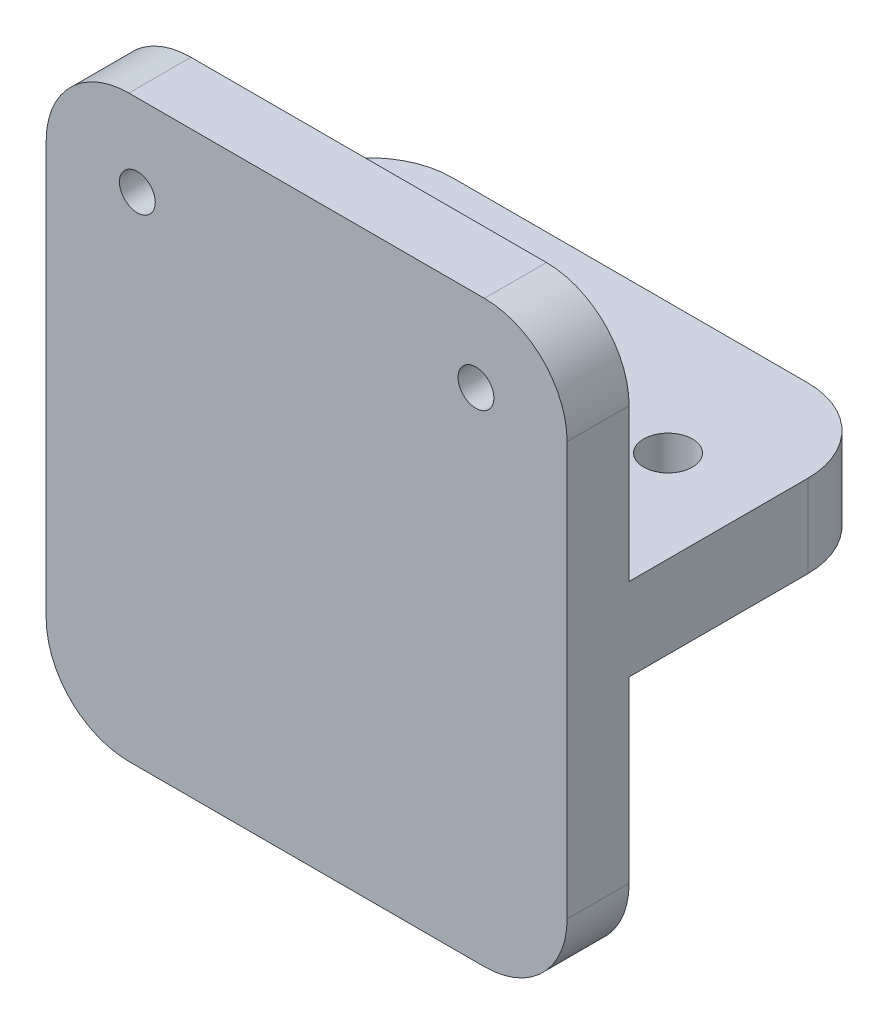
ISO-10303-21;
HEADER;
FILE_DESCRIPTION(('STEP AP214'),'2;1');
FILE_NAME('part.step','',(''),(''),'','','');
FILE_SCHEMA(('AUTOMOTIVE_DESIGN { 1 0 10303 214 1 1 1 1 }'));
ENDSEC;
DATA;
#1=APPLICATION_CONTEXT('core data for automotive mechanical design processes');
#2=APPLICATION_PROTOCOL_DEFINITION('international standard','automotive_design',2000,#1);
#3=PRODUCT_CONTEXT('',#1,'mechanical');
#4=PRODUCT('Part','Part','',(#3));
#5=PRODUCT_RELATED_PRODUCT_CATEGORY('part','',(#4));
#6=PRODUCT_DEFINITION_FORMATION('','',#4);
#7=PRODUCT_DEFINITION_CONTEXT('part definition',#1,'design');
#8=PRODUCT_DEFINITION('design','',#6,#7);
#9=PRODUCT_DEFINITION_SHAPE('','',#8);
#10=(LENGTH_UNIT() NAMED_UNIT(*) SI_UNIT(.MILLI.,.METRE.));
#11=(NAMED_UNIT(*) PLANE_ANGLE_UNIT() SI_UNIT($,.RADIAN.));
#12=(NAMED_UNIT(*) SI_UNIT($,.STERADIAN.) SOLID_ANGLE_UNIT());
#13=UNCERTAINTY_MEASURE_WITH_UNIT(LENGTH_MEASURE(1.E-05),#10,'distance_accuracy_value','');
#14=(GEOMETRIC_REPRESENTATION_CONTEXT(3) GLOBAL_UNCERTAINTY_ASSIGNED_CONTEXT((#13)) GLOBAL_UNIT_ASSIGNED_CONTEXT((#10,
#11,#12)) REPRESENTATION_CONTEXT('',''));
#15=CARTESIAN_POINT('',(0.,0.,0.));
#16=DIRECTION('',(0.,0.,1.));
#17=DIRECTION('',(1.,0.,0.));
#18=AXIS2_PLACEMENT_3D('',#15,#16,#17);
#19=CARTESIAN_POINT('',(0.,0.,0.));
#20=DIRECTION('',(0.,0.,-1.));
#21=DIRECTION('',(-1.,0.,0.));
#22=AXIS2_PLACEMENT_3D('',#19,#20,#21);
#23=PLANE('',#22);
#24=DIRECTION('',(-1.,0.,0.));
#25=VECTOR('',#24,1.);
#26=CARTESIAN_POINT('',(-20.,22.225,0.));
#27=LINE('',#26,#25);
#28=CARTESIAN_POINT('',(13.65,22.225,0.));
#29=VERTEX_POINT('',#28);
#30=CARTESIAN_POINT('',(-13.65,22.225,0.));
#31=VERTEX_POINT('',#30);
#32=EDGE_CURVE('E154',#29,#31,#27,.T.);
#33=ORIENTED_EDGE('',*,*,#32,.F.);
#34=CARTESIAN_POINT('',(13.65,15.875,0.));
#35=DIRECTION('',(0.,0.,-1.));
#36=DIRECTION('',(-1.,0.,0.));
#37=AXIS2_PLACEMENT_3D('',#34,#35,#36);
#38=CIRCLE('',#37,6.35);
#39=CARTESIAN_POINT('',(20.,15.875,0.));
#40=VERTEX_POINT('',#39);
#41=EDGE_CURVE('E11',#29,#40,#38,.T.);
#42=ORIENTED_EDGE('',*,*,#41,.T.);
#43=DIRECTION('',(0.,1.,0.));
#44=VECTOR('',#43,1.);
#45=CARTESIAN_POINT('',(20.,-22.225,0.));
#46=LINE('',#45,#44);
#47=CARTESIAN_POINT('',(20.,4.19099999999999,0.));
#48=VERTEX_POINT('',#47);
#49=EDGE_CURVE('E186',#48,#40,#46,.T.);
#50=ORIENTED_EDGE('',*,*,#49,.F.);
#51=DIRECTION('',(1.,0.,0.));
#52=VECTOR('',#51,1.);
#53=CARTESIAN_POINT('',(20.,4.19099999999999,0.));
#54=LINE('',#53,#52);
#55=CARTESIAN_POINT('',(-20.,4.19099999999999,0.));
#56=VERTEX_POINT('',#55);
#57=EDGE_CURVE('E159',#56,#48,#54,.T.);
#58=ORIENTED_EDGE('',*,*,#57,.F.);
#59=DIRECTION('',(0.,-1.,0.));
#60=VECTOR('',#59,1.);
#61=CARTESIAN_POINT('',(-20.,-22.225,0.));
#62=LINE('',#61,#60);
#63=CARTESIAN_POINT('',(-20.,15.875,0.));
#64=VERTEX_POINT('',#63);
#65=EDGE_CURVE('E153',#64,#56,#62,.T.);
#66=ORIENTED_EDGE('',*,*,#65,.F.);
#67=CARTESIAN_POINT('',(-13.65,15.875,0.));
#68=DIRECTION('',(0.,0.,-1.));
#69=DIRECTION('',(-1.,0.,0.));
#70=AXIS2_PLACEMENT_3D('',#67,#68,#69);
#71=CIRCLE('',#70,6.35);
#72=EDGE_CURVE('E40',#64,#31,#71,.T.);
#73=ORIENTED_EDGE('',*,*,#72,.T.);
#74=EDGE_LOOP('',(#33,#42,#50,#58,#66,#73));
#75=FACE_BOUND('',#74,.T.);
#76=CARTESIAN_POINT('',(-13.,15.9586820083682,0.));
#77=DIRECTION('',(0.,0.,1.));
#78=DIRECTION('',(1.,0.,0.));
#79=AXIS2_PLACEMENT_3D('',#76,#77,#78);
#80=CIRCLE('',#79,1.375);
#81=CARTESIAN_POINT('',(-11.625,15.9586820083682,0.));
#82=VERTEX_POINT('',#81);
#83=EDGE_CURVE('E180',#82,#82,#80,.T.);
#84=ORIENTED_EDGE('',*,*,#83,.T.);
#85=EDGE_LOOP('',(#84));
#86=FACE_BOUND('',#85,.T.);
#87=CARTESIAN_POINT('',(13.,15.9586820083682,0.));
#88=DIRECTION('',(0.,0.,1.));
#89=DIRECTION('',(1.,0.,0.));
#90=AXIS2_PLACEMENT_3D('',#87,#88,#89);
#91=CIRCLE('',#90,1.375);
#92=CARTESIAN_POINT('',(14.375,15.9586820083682,0.));
#93=VERTEX_POINT('',#92);
#94=EDGE_CURVE('E176',#93,#93,#91,.T.);
#95=ORIENTED_EDGE('',*,*,#94,.T.);
#96=EDGE_LOOP('',(#95));
#97=FACE_BOUND('',#96,.T.);
#98=ADVANCED_FACE('F32',(#75,#86,#97),#23,.T.);
#99=CARTESIAN_POINT('',(0.,0.,4.7625));
#100=DIRECTION('',(0.,0.,-1.));
#101=DIRECTION('',(-1.,0.,0.));
#102=AXIS2_PLACEMENT_3D('',#99,#100,#101);
#103=PLANE('',#102);
#104=DIRECTION('',(1.,0.,0.));
#105=VECTOR('',#104,1.);
#106=CARTESIAN_POINT('',(-20.,-22.225,4.7625));
#107=LINE('',#106,#105);
#108=CARTESIAN_POINT('',(-13.65,-22.225,4.7625));
#109=VERTEX_POINT('',#108);
#110=CARTESIAN_POINT('',(13.65,-22.225,4.7625));
#111=VERTEX_POINT('',#110);
#112=EDGE_CURVE('E199',#109,#111,#107,.T.);
#113=ORIENTED_EDGE('',*,*,#112,.T.);
#114=CARTESIAN_POINT('',(13.65,-15.875,4.7625));
#115=DIRECTION('',(0.,0.,-1.));
#116=DIRECTION('',(-1.,0.,0.));
#117=AXIS2_PLACEMENT_3D('',#114,#115,#116);
#118=CIRCLE('',#117,6.35);
#119=CARTESIAN_POINT('',(20.,-15.875,4.7625));
#120=VERTEX_POINT('',#119);
#121=EDGE_CURVE('E229',#111,#120,#118,.F.);
#122=ORIENTED_EDGE('',*,*,#121,.T.);
#123=DIRECTION('',(0.,1.,0.));
#124=VECTOR('',#123,1.);
#125=CARTESIAN_POINT('',(20.,-22.225,4.7625));
#126=LINE('',#125,#124);
#127=CARTESIAN_POINT('',(20.,15.875,4.7625));
#128=VERTEX_POINT('',#127);
#129=EDGE_CURVE('E189',#120,#128,#126,.T.);
#130=ORIENTED_EDGE('',*,*,#129,.T.);
#131=CARTESIAN_POINT('',(13.65,15.875,4.7625));
#132=DIRECTION('',(0.,0.,-1.));
#133=DIRECTION('',(-1.,0.,0.));
#134=AXIS2_PLACEMENT_3D('',#131,#132,#133);
#135=CIRCLE('',#134,6.35);
#136=CARTESIAN_POINT('',(13.65,22.225,4.7625));
#137=VERTEX_POINT('',#136);
#138=EDGE_CURVE('E225',#128,#137,#135,.F.);
#139=ORIENTED_EDGE('',*,*,#138,.T.);
#140=DIRECTION('',(-1.,0.,0.));
#141=VECTOR('',#140,1.);
#142=CARTESIAN_POINT('',(-20.,22.225,4.7625));
#143=LINE('',#142,#141);
#144=CARTESIAN_POINT('',(-13.65,22.225,4.7625));
#145=VERTEX_POINT('',#144);
#146=EDGE_CURVE('E192',#137,#145,#143,.T.);
#147=ORIENTED_EDGE('',*,*,#146,.T.);
#148=CARTESIAN_POINT('',(-13.65,15.875,4.7625));
#149=DIRECTION('',(0.,0.,-1.));
#150=DIRECTION('',(-1.,0.,0.));
#151=AXIS2_PLACEMENT_3D('',#148,#149,#150);
#152=CIRCLE('',#151,6.35);
#153=CARTESIAN_POINT('',(-20.,15.875,4.7625));
#154=VERTEX_POINT('',#153);
#155=EDGE_CURVE('E223',#145,#154,#152,.F.);
#156=ORIENTED_EDGE('',*,*,#155,.T.);
#157=DIRECTION('',(0.,-1.,0.));
#158=VECTOR('',#157,1.);
#159=CARTESIAN_POINT('',(-20.,-22.225,4.7625));
#160=LINE('',#159,#158);
#161=CARTESIAN_POINT('',(-20.,-15.875,4.7625));
#162=VERTEX_POINT('',#161);
#163=EDGE_CURVE('E196',#154,#162,#160,.T.);
#164=ORIENTED_EDGE('',*,*,#163,.T.);
#165=CARTESIAN_POINT('',(-13.65,-15.875,4.7625));
#166=DIRECTION('',(0.,0.,-1.));
#167=DIRECTION('',(-1.,0.,0.));
#168=AXIS2_PLACEMENT_3D('',#165,#166,#167);
#169=CIRCLE('',#168,6.35);
#170=EDGE_CURVE('E227',#162,#109,#169,.F.);
#171=ORIENTED_EDGE('',*,*,#170,.T.);
#172=EDGE_LOOP('',(#113,#122,#130,#139,#147,#156,#164,#171));
#173=FACE_BOUND('',#172,.T.);
#174=CARTESIAN_POINT('',(-13.,15.9586820083682,4.7625));
#175=DIRECTION('',(0.,0.,1.));
#176=DIRECTION('',(1.,0.,0.));
#177=AXIS2_PLACEMENT_3D('',#174,#175,#176);
#178=CIRCLE('',#177,1.375);
#179=CARTESIAN_POINT('',(-11.625,15.9586820083682,4.7625));
#180=VERTEX_POINT('',#179);
#181=EDGE_CURVE('E183',#180,#180,#178,.T.);
#182=ORIENTED_EDGE('',*,*,#181,.F.);
#183=EDGE_LOOP('',(#182));
#184=FACE_BOUND('',#183,.T.);
#185=CARTESIAN_POINT('',(13.,15.9586820083682,4.7625));
#186=DIRECTION('',(0.,0.,1.));
#187=DIRECTION('',(1.,0.,0.));
#188=AXIS2_PLACEMENT_3D('',#185,#186,#187);
#189=CIRCLE('',#188,1.375);
#190=CARTESIAN_POINT('',(14.375,15.9586820083682,4.7625));
#191=VERTEX_POINT('',#190);
#192=EDGE_CURVE('E177',#191,#191,#189,.T.);
#193=ORIENTED_EDGE('',*,*,#192,.F.);
#194=EDGE_LOOP('',(#193));
#195=FACE_BOUND('',#194,.T.);
#196=ADVANCED_FACE('F269',(#173,#184,#195),#103,.F.);
#197=CARTESIAN_POINT('',(20.,-15.875,0.));
#198=VERTEX_POINT('',#197);
#199=CARTESIAN_POINT('',(20.,-2.15900000000001,0.));
#200=VERTEX_POINT('',#199);
#201=EDGE_CURVE('E203',#198,#200,#46,.T.);
#202=ORIENTED_EDGE('',*,*,#201,.F.);
#203=CARTESIAN_POINT('',(13.65,-15.875,0.));
#204=DIRECTION('',(0.,0.,-1.));
#205=DIRECTION('',(-1.,0.,0.));
#206=AXIS2_PLACEMENT_3D('',#203,#204,#205);
#207=CIRCLE('',#206,6.35);
#208=CARTESIAN_POINT('',(13.65,-22.225,0.));
#209=VERTEX_POINT('',#208);
#210=EDGE_CURVE('E216',#198,#209,#207,.T.);
#211=ORIENTED_EDGE('',*,*,#210,.T.);
#212=DIRECTION('',(1.,0.,0.));
#213=VECTOR('',#212,1.);
#214=CARTESIAN_POINT('',(-20.,-22.225,0.));
#215=LINE('',#214,#213);
#216=CARTESIAN_POINT('',(-13.65,-22.225,0.));
#217=VERTEX_POINT('',#216);
#218=EDGE_CURVE('E193',#217,#209,#215,.T.);
#219=ORIENTED_EDGE('',*,*,#218,.F.);
#220=CARTESIAN_POINT('',(-13.65,-15.875,0.));
#221=DIRECTION('',(0.,0.,-1.));
#222=DIRECTION('',(-1.,0.,0.));
#223=AXIS2_PLACEMENT_3D('',#220,#221,#222);
#224=CIRCLE('',#223,6.35);
#225=CARTESIAN_POINT('',(-20.,-15.875,0.));
#226=VERTEX_POINT('',#225);
#227=EDGE_CURVE('E152',#217,#226,#224,.T.);
#228=ORIENTED_EDGE('',*,*,#227,.T.);
#229=CARTESIAN_POINT('',(-20.,-2.15900000000001,0.));
#230=VERTEX_POINT('',#229);
#231=EDGE_CURVE('E135',#230,#226,#62,.T.);
#232=ORIENTED_EDGE('',*,*,#231,.F.);
#233=DIRECTION('',(-1.,0.,0.));
#234=VECTOR('',#233,1.);
#235=CARTESIAN_POINT('',(20.,-2.15900000000001,0.));
#236=LINE('',#235,#234);
#237=EDGE_CURVE('E150',#200,#230,#236,.T.);
#238=ORIENTED_EDGE('',*,*,#237,.F.);
#239=EDGE_LOOP('',(#202,#211,#219,#228,#232,#238));
#240=FACE_BOUND('',#239,.T.);
#241=ADVANCED_FACE('F149',(#240),#23,.T.);
#242=CARTESIAN_POINT('',(20.,-22.225,4.7625));
#243=DIRECTION('',(-1.,0.,0.));
#244=DIRECTION('',(0.,0.,1.));
#245=AXIS2_PLACEMENT_3D('',#242,#243,#244);
#246=PLANE('',#245);
#247=ORIENTED_EDGE('',*,*,#129,.F.);
#248=DIRECTION('',(0.,0.,-1.));
#249=VECTOR('',#248,1.);
#250=CARTESIAN_POINT('',(20.,-15.875,4.7625));
#251=LINE('',#250,#249);
#252=EDGE_CURVE('E212',#120,#198,#251,.T.);
#253=ORIENTED_EDGE('',*,*,#252,.T.);
#254=ORIENTED_EDGE('',*,*,#201,.T.);
#255=DIRECTION('',(0.,0.,1.));
#256=VECTOR('',#255,1.);
#257=CARTESIAN_POINT('',(20.,-2.15900000000001,-20.066));
#258=LINE('',#257,#256);
#259=CARTESIAN_POINT('',(20.,-2.15900000000001,-13.716));
#260=VERTEX_POINT('',#259);
#261=EDGE_CURVE('E143',#260,#200,#258,.T.);
#262=ORIENTED_EDGE('',*,*,#261,.F.);
#263=DIRECTION('',(0.,-1.,0.));
#264=VECTOR('',#263,1.);
#265=CARTESIAN_POINT('',(20.,4.19099999999999,-13.716));
#266=LINE('',#265,#264);
#267=CARTESIAN_POINT('',(20.,4.19099999999999,-13.716));
#268=VERTEX_POINT('',#267);
#269=EDGE_CURVE('E210',#260,#268,#266,.F.);
#270=ORIENTED_EDGE('',*,*,#269,.T.);
#271=DIRECTION('',(0.,0.,1.));
#272=VECTOR('',#271,1.);
#273=CARTESIAN_POINT('',(20.,4.19099999999999,-20.066));
#274=LINE('',#273,#272);
#275=EDGE_CURVE('E172',#268,#48,#274,.T.);
#276=ORIENTED_EDGE('',*,*,#275,.T.);
#277=ORIENTED_EDGE('',*,*,#49,.T.);
#278=DIRECTION('',(0.,0.,-1.));
#279=VECTOR('',#278,1.);
#280=CARTESIAN_POINT('',(20.,15.875,4.7625));
#281=LINE('',#280,#279);
#282=EDGE_CURVE('E202',#40,#128,#281,.F.);
#283=ORIENTED_EDGE('',*,*,#282,.T.);
#284=EDGE_LOOP('',(#247,#253,#254,#262,#270,#276,#277,#283));
#285=FACE_BOUND('',#284,.T.);
#286=ADVANCED_FACE('F265',(#285),#246,.F.);
#287=CARTESIAN_POINT('',(-20.,22.225,4.7625));
#288=DIRECTION('',(0.,-1.,0.));
#289=DIRECTION('',(1.,0.,0.));
#290=AXIS2_PLACEMENT_3D('',#287,#288,#289);
#291=PLANE('',#290);
#292=ORIENTED_EDGE('',*,*,#146,.F.);
#293=DIRECTION('',(0.,0.,-1.));
#294=VECTOR('',#293,1.);
#295=CARTESIAN_POINT('',(13.65,22.225,4.7625));
#296=LINE('',#295,#294);
#297=EDGE_CURVE('E253',#137,#29,#296,.T.);
#298=ORIENTED_EDGE('',*,*,#297,.T.);
#299=ORIENTED_EDGE('',*,*,#32,.T.);
#300=DIRECTION('',(0.,0.,-1.));
#301=VECTOR('',#300,1.);
#302=CARTESIAN_POINT('',(-13.65,22.225,4.7625));
#303=LINE('',#302,#301);
#304=EDGE_CURVE('E251',#31,#145,#303,.F.);
#305=ORIENTED_EDGE('',*,*,#304,.T.);
#306=EDGE_LOOP('',(#292,#298,#299,#305));
#307=FACE_BOUND('',#306,.T.);
#308=ADVANCED_FACE('F256',(#307),#291,.F.);
#309=CARTESIAN_POINT('',(-20.,-22.225,4.7625));
#310=DIRECTION('',(1.,0.,0.));
#311=DIRECTION('',(0.,1.,0.));
#312=AXIS2_PLACEMENT_3D('',#309,#310,#311);
#313=PLANE('',#312);
#314=ORIENTED_EDGE('',*,*,#231,.T.);
#315=DIRECTION('',(0.,0.,-1.));
#316=VECTOR('',#315,1.);
#317=CARTESIAN_POINT('',(-20.,-15.875,4.7625));
#318=LINE('',#317,#316);
#319=EDGE_CURVE('E235',#226,#162,#318,.F.);
#320=ORIENTED_EDGE('',*,*,#319,.T.);
#321=ORIENTED_EDGE('',*,*,#163,.F.);
#322=DIRECTION('',(0.,0.,-1.));
#323=VECTOR('',#322,1.);
#324=CARTESIAN_POINT('',(-20.,15.875,4.7625));
#325=LINE('',#324,#323);
#326=EDGE_CURVE('E231',#154,#64,#325,.T.);
#327=ORIENTED_EDGE('',*,*,#326,.T.);
#328=ORIENTED_EDGE('',*,*,#65,.T.);
#329=DIRECTION('',(0.,0.,1.));
#330=VECTOR('',#329,1.);
#331=CARTESIAN_POINT('',(-20.,4.19099999999999,-20.066));
#332=LINE('',#331,#330);
#333=CARTESIAN_POINT('',(-20.,4.19099999999999,-13.716));
#334=VERTEX_POINT('',#333);
#335=EDGE_CURVE('E144',#334,#56,#332,.T.);
#336=ORIENTED_EDGE('',*,*,#335,.F.);
#337=DIRECTION('',(0.,1.,0.));
#338=VECTOR('',#337,1.);
#339=CARTESIAN_POINT('',(-20.,-2.15900000000001,-13.716));
#340=LINE('',#339,#338);
#341=CARTESIAN_POINT('',(-20.,-2.15900000000001,-13.716));
#342=VERTEX_POINT('',#341);
#343=EDGE_CURVE('E139',#334,#342,#340,.F.);
#344=ORIENTED_EDGE('',*,*,#343,.T.);
#345=DIRECTION('',(0.,0.,1.));
#346=VECTOR('',#345,1.);
#347=CARTESIAN_POINT('',(-20.,-2.15900000000001,-20.066));
#348=LINE('',#347,#346);
#349=EDGE_CURVE('E132',#342,#230,#348,.T.);
#350=ORIENTED_EDGE('',*,*,#349,.T.);
#351=EDGE_LOOP('',(#314,#320,#321,#327,#328,#336,#344,#350));
#352=FACE_BOUND('',#351,.T.);
#353=ADVANCED_FACE('F134',(#352),#313,.F.);
#354=CARTESIAN_POINT('',(-20.,-22.225,4.7625));
#355=DIRECTION('',(0.,1.,0.));
#356=DIRECTION('',(0.,0.,1.));
#357=AXIS2_PLACEMENT_3D('',#354,#355,#356);
#358=PLANE('',#357);
#359=ORIENTED_EDGE('',*,*,#218,.T.);
#360=DIRECTION('',(0.,0.,-1.));
#361=VECTOR('',#360,1.);
#362=CARTESIAN_POINT('',(13.65,-22.225,4.7625));
#363=LINE('',#362,#361);
#364=EDGE_CURVE('E221',#209,#111,#363,.F.);
#365=ORIENTED_EDGE('',*,*,#364,.T.);
#366=ORIENTED_EDGE('',*,*,#112,.F.);
#367=DIRECTION('',(0.,0.,-1.));
#368=VECTOR('',#367,1.);
#369=CARTESIAN_POINT('',(-13.65,-22.225,4.7625));
#370=LINE('',#369,#368);
#371=EDGE_CURVE('E218',#109,#217,#370,.T.);
#372=ORIENTED_EDGE('',*,*,#371,.T.);
#373=EDGE_LOOP('',(#359,#365,#366,#372));
#374=FACE_BOUND('',#373,.T.);
#375=ADVANCED_FACE('F278',(#374),#358,.F.);
#376=CARTESIAN_POINT('',(-13.,15.9586820083682,4.7625));
#377=DIRECTION('',(0.,0.,-1.));
#378=DIRECTION('',(-1.,0.,0.));
#379=AXIS2_PLACEMENT_3D('',#376,#377,#378);
#380=CYLINDRICAL_SURFACE('',#379,1.375);
#381=ORIENTED_EDGE('',*,*,#181,.T.);
#382=EDGE_LOOP('',(#381));
#383=FACE_BOUND('',#382,.T.);
#384=ORIENTED_EDGE('',*,*,#83,.F.);
#385=EDGE_LOOP('',(#384));
#386=FACE_BOUND('',#385,.T.);
#387=ADVANCED_FACE('F331',(#383,#386),#380,.F.);
#388=CARTESIAN_POINT('',(13.,15.9586820083682,4.7625));
#389=DIRECTION('',(0.,0.,-1.));
#390=DIRECTION('',(-1.,0.,0.));
#391=AXIS2_PLACEMENT_3D('',#388,#389,#390);
#392=CYLINDRICAL_SURFACE('',#391,1.375);
#393=ORIENTED_EDGE('',*,*,#192,.T.);
#394=EDGE_LOOP('',(#393));
#395=FACE_BOUND('',#394,.T.);
#396=ORIENTED_EDGE('',*,*,#94,.F.);
#397=EDGE_LOOP('',(#396));
#398=FACE_BOUND('',#397,.T.);
#399=ADVANCED_FACE('F325',(#395,#398),#392,.F.);
#400=CARTESIAN_POINT('',(20.,-2.15900000000001,-20.066));
#401=DIRECTION('',(0.,1.,0.));
#402=DIRECTION('',(-1.,0.,0.));
#403=AXIS2_PLACEMENT_3D('',#400,#401,#402);
#404=PLANE('',#403);
#405=CARTESIAN_POINT('',(12.954,-2.15900000000001,-10.033));
#406=DIRECTION('',(0.,1.,0.));
#407=DIRECTION('',(-1.,0.,0.));
#408=AXIS2_PLACEMENT_3D('',#405,#406,#407);
#409=CIRCLE('',#408,1.875);
#410=CARTESIAN_POINT('',(11.079,-2.15900000000001,-10.033));
#411=VERTEX_POINT('',#410);
#412=EDGE_CURVE('E160',#411,#411,#409,.T.);
#413=ORIENTED_EDGE('',*,*,#412,.T.);
#414=EDGE_LOOP('',(#413));
#415=FACE_BOUND('',#414,.T.);
#416=CARTESIAN_POINT('',(-12.954,-2.15900000000001,-10.033));
#417=DIRECTION('',(0.,1.,0.));
#418=DIRECTION('',(-1.,0.,0.));
#419=AXIS2_PLACEMENT_3D('',#416,#417,#418);
#420=CIRCLE('',#419,1.875);
#421=CARTESIAN_POINT('',(-14.829,-2.15900000000001,-10.033));
#422=VERTEX_POINT('',#421);
#423=EDGE_CURVE('E166',#422,#422,#420,.T.);
#424=ORIENTED_EDGE('',*,*,#423,.T.);
#425=EDGE_LOOP('',(#424));
#426=FACE_BOUND('',#425,.T.);
#427=ORIENTED_EDGE('',*,*,#349,.F.);
#428=CARTESIAN_POINT('',(-13.65,-2.15900000000001,-13.716));
#429=DIRECTION('',(0.,1.,0.));
#430=DIRECTION('',(-1.,0.,0.));
#431=AXIS2_PLACEMENT_3D('',#428,#429,#430);
#432=CIRCLE('',#431,6.35);
#433=CARTESIAN_POINT('',(-13.65,-2.15900000000001,-20.066));
#434=VERTEX_POINT('',#433);
#435=EDGE_CURVE('E249',#342,#434,#432,.F.);
#436=ORIENTED_EDGE('',*,*,#435,.T.);
#437=DIRECTION('',(-1.,0.,0.));
#438=VECTOR('',#437,1.);
#439=CARTESIAN_POINT('',(20.,-2.15900000000001,-20.066));
#440=LINE('',#439,#438);
#441=CARTESIAN_POINT('',(13.65,-2.15900000000001,-20.066));
#442=VERTEX_POINT('',#441);
#443=EDGE_CURVE('E163',#442,#434,#440,.T.);
#444=ORIENTED_EDGE('',*,*,#443,.F.);
#445=CARTESIAN_POINT('',(13.65,-2.15900000000001,-13.716));
#446=DIRECTION('',(0.,1.,0.));
#447=DIRECTION('',(-1.,0.,0.));
#448=AXIS2_PLACEMENT_3D('',#445,#446,#447);
#449=CIRCLE('',#448,6.35);
#450=EDGE_CURVE('E247',#442,#260,#449,.F.);
#451=ORIENTED_EDGE('',*,*,#450,.T.);
#452=ORIENTED_EDGE('',*,*,#261,.T.);
#453=ORIENTED_EDGE('',*,*,#237,.T.);
#454=EDGE_LOOP('',(#427,#436,#444,#451,#452,#453));
#455=FACE_BOUND('',#454,.T.);
#456=ADVANCED_FACE('F156',(#415,#426,#455),#404,.F.);
#457=CARTESIAN_POINT('',(20.,4.19099999999999,-20.066));
#458=DIRECTION('',(0.,-1.,0.));
#459=DIRECTION('',(0.,0.,-1.));
#460=AXIS2_PLACEMENT_3D('',#457,#458,#459);
#461=PLANE('',#460);
#462=CARTESIAN_POINT('',(12.954,4.19099999999999,-10.033));
#463=DIRECTION('',(0.,1.,0.));
#464=DIRECTION('',(0.,0.,1.));
#465=AXIS2_PLACEMENT_3D('',#462,#463,#464);
#466=CIRCLE('',#465,1.875);
#467=CARTESIAN_POINT('',(12.954,4.19099999999999,-8.158));
#468=VERTEX_POINT('',#467);
#469=EDGE_CURVE('E303',#468,#468,#466,.T.);
#470=ORIENTED_EDGE('',*,*,#469,.F.);
#471=EDGE_LOOP('',(#470));
#472=FACE_BOUND('',#471,.T.);
#473=CARTESIAN_POINT('',(-12.954,4.19099999999999,-10.033));
#474=DIRECTION('',(0.,1.,0.));
#475=DIRECTION('',(0.,0.,1.));
#476=AXIS2_PLACEMENT_3D('',#473,#474,#475);
#477=CIRCLE('',#476,1.875);
#478=CARTESIAN_POINT('',(-12.954,4.19099999999999,-8.158));
#479=VERTEX_POINT('',#478);
#480=EDGE_CURVE('E304',#479,#479,#477,.T.);
#481=ORIENTED_EDGE('',*,*,#480,.F.);
#482=EDGE_LOOP('',(#481));
#483=FACE_BOUND('',#482,.T.);
#484=DIRECTION('',(1.,0.,0.));
#485=VECTOR('',#484,1.);
#486=CARTESIAN_POINT('',(20.,4.19099999999999,-20.066));
#487=LINE('',#486,#485);
#488=CARTESIAN_POINT('',(-13.65,4.19099999999999,-20.066));
#489=VERTEX_POINT('',#488);
#490=CARTESIAN_POINT('',(13.65,4.19099999999999,-20.066));
#491=VERTEX_POINT('',#490);
#492=EDGE_CURVE('E169',#489,#491,#487,.T.);
#493=ORIENTED_EDGE('',*,*,#492,.F.);
#494=CARTESIAN_POINT('',(-13.65,4.19099999999999,-13.716));
#495=DIRECTION('',(0.,-1.,0.));
#496=DIRECTION('',(0.,0.,-1.));
#497=AXIS2_PLACEMENT_3D('',#494,#495,#496);
#498=CIRCLE('',#497,6.35);
#499=EDGE_CURVE('E245',#489,#334,#498,.F.);
#500=ORIENTED_EDGE('',*,*,#499,.T.);
#501=ORIENTED_EDGE('',*,*,#335,.T.);
#502=ORIENTED_EDGE('',*,*,#57,.T.);
#503=ORIENTED_EDGE('',*,*,#275,.F.);
#504=CARTESIAN_POINT('',(13.65,4.19099999999999,-13.716));
#505=DIRECTION('',(0.,-1.,0.));
#506=DIRECTION('',(0.,0.,-1.));
#507=AXIS2_PLACEMENT_3D('',#504,#505,#506);
#508=CIRCLE('',#507,6.35);
#509=EDGE_CURVE('E243',#268,#491,#508,.F.);
#510=ORIENTED_EDGE('',*,*,#509,.T.);
#511=EDGE_LOOP('',(#493,#500,#501,#502,#503,#510));
#512=FACE_BOUND('',#511,.T.);
#513=ADVANCED_FACE('F289',(#472,#483,#512),#461,.F.);
#514=CARTESIAN_POINT('',(0.,0.,-20.066));
#515=DIRECTION('',(0.,0.,-1.));
#516=DIRECTION('',(-1.,0.,0.));
#517=AXIS2_PLACEMENT_3D('',#514,#515,#516);
#518=PLANE('',#517);
#519=ORIENTED_EDGE('',*,*,#443,.T.);
#520=DIRECTION('',(0.,1.,0.));
#521=VECTOR('',#520,1.);
#522=CARTESIAN_POINT('',(-13.65,4.19099999999999,-20.066));
#523=LINE('',#522,#521);
#524=EDGE_CURVE('E240',#434,#489,#523,.T.);
#525=ORIENTED_EDGE('',*,*,#524,.T.);
#526=ORIENTED_EDGE('',*,*,#492,.T.);
#527=DIRECTION('',(0.,-1.,0.));
#528=VECTOR('',#527,1.);
#529=CARTESIAN_POINT('',(13.65,-2.15900000000001,-20.066));
#530=LINE('',#529,#528);
#531=EDGE_CURVE('E237',#491,#442,#530,.T.);
#532=ORIENTED_EDGE('',*,*,#531,.T.);
#533=EDGE_LOOP('',(#519,#525,#526,#532));
#534=FACE_BOUND('',#533,.T.);
#535=ADVANCED_FACE('F297',(#534),#518,.T.);
#536=CARTESIAN_POINT('',(-12.954,-22.225,-10.033));
#537=DIRECTION('',(0.,1.,0.));
#538=DIRECTION('',(0.,0.,1.));
#539=AXIS2_PLACEMENT_3D('',#536,#537,#538);
#540=CYLINDRICAL_SURFACE('',#539,1.875);
#541=ORIENTED_EDGE('',*,*,#480,.T.);
#542=EDGE_LOOP('',(#541));
#543=FACE_BOUND('',#542,.T.);
#544=ORIENTED_EDGE('',*,*,#423,.F.);
#545=EDGE_LOOP('',(#544));
#546=FACE_BOUND('',#545,.T.);
#547=ADVANCED_FACE('F318',(#543,#546),#540,.F.);
#548=CARTESIAN_POINT('',(12.954,-22.225,-10.033));
#549=DIRECTION('',(0.,1.,0.));
#550=DIRECTION('',(0.,0.,1.));
#551=AXIS2_PLACEMENT_3D('',#548,#549,#550);
#552=CYLINDRICAL_SURFACE('',#551,1.875);
#553=ORIENTED_EDGE('',*,*,#469,.T.);
#554=EDGE_LOOP('',(#553));
#555=FACE_BOUND('',#554,.T.);
#556=ORIENTED_EDGE('',*,*,#412,.F.);
#557=EDGE_LOOP('',(#556));
#558=FACE_BOUND('',#557,.T.);
#559=ADVANCED_FACE('F310',(#555,#558),#552,.F.);
#560=CARTESIAN_POINT('',(13.65,-15.875,4.7625));
#561=DIRECTION('',(0.,0.,-1.));
#562=DIRECTION('',(-1.,0.,0.));
#563=AXIS2_PLACEMENT_3D('',#560,#561,#562);
#564=CYLINDRICAL_SURFACE('',#563,6.35);
#565=ORIENTED_EDGE('',*,*,#121,.F.);
#566=ORIENTED_EDGE('',*,*,#364,.F.);
#567=ORIENTED_EDGE('',*,*,#210,.F.);
#568=ORIENTED_EDGE('',*,*,#252,.F.);
#569=EDGE_LOOP('',(#565,#566,#567,#568));
#570=FACE_BOUND('',#569,.T.);
#571=ADVANCED_FACE('F275',(#570),#564,.T.);
#572=CARTESIAN_POINT('',(-13.65,-15.875,4.7625));
#573=DIRECTION('',(0.,0.,-1.));
#574=DIRECTION('',(-1.,0.,0.));
#575=AXIS2_PLACEMENT_3D('',#572,#573,#574);
#576=CYLINDRICAL_SURFACE('',#575,6.35);
#577=ORIENTED_EDGE('',*,*,#170,.F.);
#578=ORIENTED_EDGE('',*,*,#319,.F.);
#579=ORIENTED_EDGE('',*,*,#227,.F.);
#580=ORIENTED_EDGE('',*,*,#371,.F.);
#581=EDGE_LOOP('',(#577,#578,#579,#580));
#582=FACE_BOUND('',#581,.T.);
#583=ADVANCED_FACE('F283',(#582),#576,.T.);
#584=CARTESIAN_POINT('',(-13.65,0.,-13.716));
#585=DIRECTION('',(0.,-1.,0.));
#586=DIRECTION('',(1.,0.,0.));
#587=AXIS2_PLACEMENT_3D('',#584,#585,#586);
#588=CYLINDRICAL_SURFACE('',#587,6.35);
#589=ORIENTED_EDGE('',*,*,#435,.F.);
#590=ORIENTED_EDGE('',*,*,#343,.F.);
#591=ORIENTED_EDGE('',*,*,#499,.F.);
#592=ORIENTED_EDGE('',*,*,#524,.F.);
#593=EDGE_LOOP('',(#589,#590,#591,#592));
#594=FACE_BOUND('',#593,.T.);
#595=ADVANCED_FACE('F292',(#594),#588,.T.);
#596=CARTESIAN_POINT('',(13.65,0.,-13.716));
#597=DIRECTION('',(0.,1.,0.));
#598=DIRECTION('',(0.,0.,1.));
#599=AXIS2_PLACEMENT_3D('',#596,#597,#598);
#600=CYLINDRICAL_SURFACE('',#599,6.35);
#601=ORIENTED_EDGE('',*,*,#509,.F.);
#602=ORIENTED_EDGE('',*,*,#269,.F.);
#603=ORIENTED_EDGE('',*,*,#450,.F.);
#604=ORIENTED_EDGE('',*,*,#531,.F.);
#605=EDGE_LOOP('',(#601,#602,#603,#604));
#606=FACE_BOUND('',#605,.T.);
#607=ADVANCED_FACE('F358',(#606),#600,.T.);
#608=CARTESIAN_POINT('',(13.65,15.875,4.7625));
#609=DIRECTION('',(0.,0.,-1.));
#610=DIRECTION('',(-1.,0.,0.));
#611=AXIS2_PLACEMENT_3D('',#608,#609,#610);
#612=CYLINDRICAL_SURFACE('',#611,6.35);
#613=ORIENTED_EDGE('',*,*,#138,.F.);
#614=ORIENTED_EDGE('',*,*,#282,.F.);
#615=ORIENTED_EDGE('',*,*,#41,.F.);
#616=ORIENTED_EDGE('',*,*,#297,.F.);
#617=EDGE_LOOP('',(#613,#614,#615,#616));
#618=FACE_BOUND('',#617,.T.);
#619=ADVANCED_FACE('F267',(#618),#612,.T.);
#620=CARTESIAN_POINT('',(-13.65,15.875,4.7625));
#621=DIRECTION('',(0.,0.,-1.));
#622=DIRECTION('',(-1.,0.,0.));
#623=AXIS2_PLACEMENT_3D('',#620,#621,#622);
#624=CYLINDRICAL_SURFACE('',#623,6.35);
#625=ORIENTED_EDGE('',*,*,#155,.F.);
#626=ORIENTED_EDGE('',*,*,#304,.F.);
#627=ORIENTED_EDGE('',*,*,#72,.F.);
#628=ORIENTED_EDGE('',*,*,#326,.F.);
#629=EDGE_LOOP('',(#625,#626,#627,#628));
#630=FACE_BOUND('',#629,.T.);
#631=ADVANCED_FACE('F34',(#630),#624,.T.);
#632=CLOSED_SHELL('',(#98,#196,#241,#286,#308,#353,#375,#387,#399,#456,#513,#535,#547,#559,#571,
#583,#595,#607,#619,#631));
#633=MANIFOLD_SOLID_BREP('B2',#632);
#634=ADVANCED_BREP_SHAPE_REPRESENTATION('',(#18,#633),#14);
#635=SHAPE_DEFINITION_REPRESENTATION(#9,#634);
ENDSEC;
END-ISO-10303-21;
